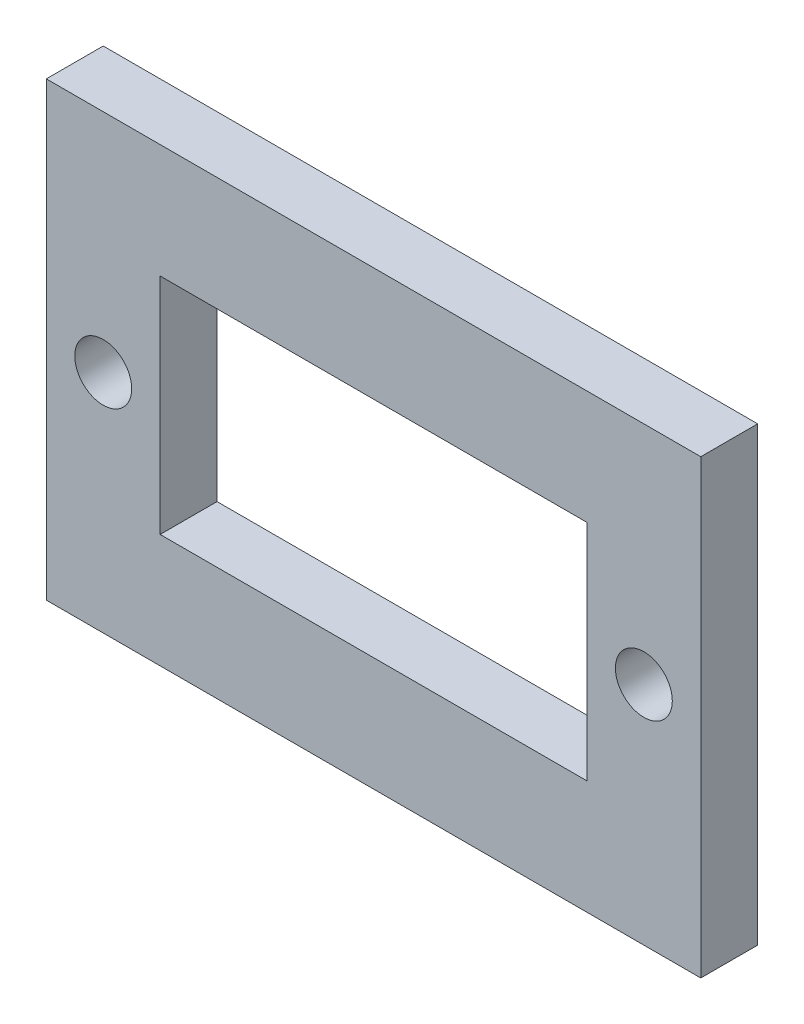
ISO-10303-21;
HEADER;
FILE_DESCRIPTION(('STEP AP214'),'2;1');
FILE_NAME('part.step','',(''),(''),'','','');
FILE_SCHEMA(('AUTOMOTIVE_DESIGN { 1 0 10303 214 1 1 1 1 }'));
ENDSEC;
DATA;
#1=APPLICATION_CONTEXT('core data for automotive mechanical design processes');
#2=APPLICATION_PROTOCOL_DEFINITION('international standard','automotive_design',2000,#1);
#3=PRODUCT_CONTEXT('',#1,'mechanical');
#4=PRODUCT('Part','Part','',(#3));
#5=PRODUCT_RELATED_PRODUCT_CATEGORY('part','',(#4));
#6=PRODUCT_DEFINITION_FORMATION('','',#4);
#7=PRODUCT_DEFINITION_CONTEXT('part definition',#1,'design');
#8=PRODUCT_DEFINITION('design','',#6,#7);
#9=PRODUCT_DEFINITION_SHAPE('','',#8);
#10=(LENGTH_UNIT() NAMED_UNIT(*) SI_UNIT(.MILLI.,.METRE.));
#11=(NAMED_UNIT(*) PLANE_ANGLE_UNIT() SI_UNIT($,.RADIAN.));
#12=(NAMED_UNIT(*) SI_UNIT($,.STERADIAN.) SOLID_ANGLE_UNIT());
#13=UNCERTAINTY_MEASURE_WITH_UNIT(LENGTH_MEASURE(1.E-05),#10,'distance_accuracy_value','');
#14=(GEOMETRIC_REPRESENTATION_CONTEXT(3) GLOBAL_UNCERTAINTY_ASSIGNED_CONTEXT((#13)) GLOBAL_UNIT_ASSIGNED_CONTEXT((#10,
#11,#12)) REPRESENTATION_CONTEXT('',''));
#15=CARTESIAN_POINT('',(0.,0.,0.));
#16=DIRECTION('',(0.,0.,1.));
#17=DIRECTION('',(1.,0.,0.));
#18=AXIS2_PLACEMENT_3D('',#15,#16,#17);
#19=CARTESIAN_POINT('',(0.,0.,3.));
#20=DIRECTION('',(0.,0.,1.));
#21=DIRECTION('',(1.,0.,0.));
#22=AXIS2_PLACEMENT_3D('',#19,#20,#21);
#23=PLANE('',#22);
#24=CARTESIAN_POINT('',(-3.,5.9,3.));
#25=DIRECTION('',(0.,0.,1.));
#26=DIRECTION('',(1.,0.,0.));
#27=AXIS2_PLACEMENT_3D('',#24,#25,#26);
#28=CIRCLE('',#27,1.5);
#29=CARTESIAN_POINT('',(-1.5,5.9,3.));
#30=VERTEX_POINT('',#29);
#31=EDGE_CURVE('E127',#30,#30,#28,.T.);
#32=ORIENTED_EDGE('',*,*,#31,.F.);
#33=EDGE_LOOP('',(#32));
#34=FACE_BOUND('',#33,.T.);
#35=DIRECTION('',(0.,1.,0.));
#36=VECTOR('',#35,1.);
#37=CARTESIAN_POINT('',(28.5,17.8,3.));
#38=LINE('',#37,#36);
#39=CARTESIAN_POINT('',(28.5,-6.,3.));
#40=VERTEX_POINT('',#39);
#41=CARTESIAN_POINT('',(28.5,17.8,3.));
#42=VERTEX_POINT('',#41);
#43=EDGE_CURVE('E137',#40,#42,#38,.T.);
#44=ORIENTED_EDGE('',*,*,#43,.T.);
#45=DIRECTION('',(-1.,0.,0.));
#46=VECTOR('',#45,1.);
#47=CARTESIAN_POINT('',(-6.00000000000001,17.8,3.));
#48=LINE('',#47,#46);
#49=CARTESIAN_POINT('',(-6.00000000000001,17.8,3.));
#50=VERTEX_POINT('',#49);
#51=EDGE_CURVE('E140',#42,#50,#48,.T.);
#52=ORIENTED_EDGE('',*,*,#51,.T.);
#53=DIRECTION('',(0.,-1.,0.));
#54=VECTOR('',#53,1.);
#55=CARTESIAN_POINT('',(-6.00000000000001,17.8,3.));
#56=LINE('',#55,#54);
#57=CARTESIAN_POINT('',(-6.00000000000001,-6.,3.));
#58=VERTEX_POINT('',#57);
#59=EDGE_CURVE('E143',#50,#58,#56,.T.);
#60=ORIENTED_EDGE('',*,*,#59,.T.);
#61=DIRECTION('',(1.,0.,0.));
#62=VECTOR('',#61,1.);
#63=CARTESIAN_POINT('',(-6.00000000000001,-6.,3.));
#64=LINE('',#63,#62);
#65=EDGE_CURVE('E145',#58,#40,#64,.T.);
#66=ORIENTED_EDGE('',*,*,#65,.T.);
#67=EDGE_LOOP('',(#44,#52,#60,#66));
#68=FACE_BOUND('',#67,.T.);
#69=DIRECTION('',(1.,0.,0.));
#70=VECTOR('',#69,1.);
#71=CARTESIAN_POINT('',(0.,0.,3.));
#72=LINE('',#71,#70);
#73=CARTESIAN_POINT('',(0.,0.,3.));
#74=VERTEX_POINT('',#73);
#75=CARTESIAN_POINT('',(22.5,0.,3.));
#76=VERTEX_POINT('',#75);
#77=EDGE_CURVE('E106',#74,#76,#72,.T.);
#78=ORIENTED_EDGE('',*,*,#77,.F.);
#79=DIRECTION('',(0.,-1.,0.));
#80=VECTOR('',#79,1.);
#81=CARTESIAN_POINT('',(0.,0.,3.));
#82=LINE('',#81,#80);
#83=CARTESIAN_POINT('',(0.,11.8,3.));
#84=VERTEX_POINT('',#83);
#85=EDGE_CURVE('E98',#84,#74,#82,.T.);
#86=ORIENTED_EDGE('',*,*,#85,.F.);
#87=DIRECTION('',(-1.,0.,0.));
#88=VECTOR('',#87,1.);
#89=CARTESIAN_POINT('',(0.,11.8,3.));
#90=LINE('',#89,#88);
#91=CARTESIAN_POINT('',(22.5,11.8,3.));
#92=VERTEX_POINT('',#91);
#93=EDGE_CURVE('E121',#92,#84,#90,.T.);
#94=ORIENTED_EDGE('',*,*,#93,.F.);
#95=DIRECTION('',(0.,1.,0.));
#96=VECTOR('',#95,1.);
#97=CARTESIAN_POINT('',(22.5,0.,3.));
#98=LINE('',#97,#96);
#99=EDGE_CURVE('E119',#76,#92,#98,.T.);
#100=ORIENTED_EDGE('',*,*,#99,.F.);
#101=EDGE_LOOP('',(#78,#86,#94,#100));
#102=FACE_BOUND('',#101,.T.);
#103=CARTESIAN_POINT('',(25.5,5.9,3.));
#104=DIRECTION('',(0.,0.,1.));
#105=DIRECTION('',(1.,0.,0.));
#106=AXIS2_PLACEMENT_3D('',#103,#104,#105);
#107=CIRCLE('',#106,1.5);
#108=CARTESIAN_POINT('',(27.,5.9,3.));
#109=VERTEX_POINT('',#108);
#110=EDGE_CURVE('E228',#109,#109,#107,.T.);
#111=ORIENTED_EDGE('',*,*,#110,.F.);
#112=EDGE_LOOP('',(#111));
#113=FACE_BOUND('',#112,.T.);
#114=ADVANCED_FACE('F33',(#34,#68,#102,#113),#23,.T.);
#115=CARTESIAN_POINT('',(0.,0.,0.));
#116=DIRECTION('',(0.,0.,1.));
#117=DIRECTION('',(1.,0.,0.));
#118=AXIS2_PLACEMENT_3D('',#115,#116,#117);
#119=PLANE('',#118);
#120=CARTESIAN_POINT('',(-3.,5.9,0.));
#121=DIRECTION('',(0.,0.,1.));
#122=DIRECTION('',(1.,0.,0.));
#123=AXIS2_PLACEMENT_3D('',#120,#121,#122);
#124=CIRCLE('',#123,1.5);
#125=CARTESIAN_POINT('',(-1.5,5.9,0.));
#126=VERTEX_POINT('',#125);
#127=EDGE_CURVE('E234',#126,#126,#124,.T.);
#128=ORIENTED_EDGE('',*,*,#127,.T.);
#129=EDGE_LOOP('',(#128));
#130=FACE_BOUND('',#129,.T.);
#131=DIRECTION('',(0.,1.,0.));
#132=VECTOR('',#131,1.);
#133=CARTESIAN_POINT('',(28.5,17.8,0.));
#134=LINE('',#133,#132);
#135=CARTESIAN_POINT('',(28.5,-6.,0.));
#136=VERTEX_POINT('',#135);
#137=CARTESIAN_POINT('',(28.5,17.8,0.));
#138=VERTEX_POINT('',#137);
#139=EDGE_CURVE('E114',#136,#138,#134,.T.);
#140=ORIENTED_EDGE('',*,*,#139,.F.);
#141=DIRECTION('',(1.,0.,0.));
#142=VECTOR('',#141,1.);
#143=CARTESIAN_POINT('',(-6.00000000000001,-6.,0.));
#144=LINE('',#143,#142);
#145=CARTESIAN_POINT('',(-6.00000000000001,-6.,0.));
#146=VERTEX_POINT('',#145);
#147=EDGE_CURVE('E141',#146,#136,#144,.T.);
#148=ORIENTED_EDGE('',*,*,#147,.F.);
#149=DIRECTION('',(0.,-1.,0.));
#150=VECTOR('',#149,1.);
#151=CARTESIAN_POINT('',(-6.00000000000001,17.8,0.));
#152=LINE('',#151,#150);
#153=CARTESIAN_POINT('',(-6.00000000000001,17.8,0.));
#154=VERTEX_POINT('',#153);
#155=EDGE_CURVE('E152',#154,#146,#152,.T.);
#156=ORIENTED_EDGE('',*,*,#155,.F.);
#157=DIRECTION('',(-1.,0.,0.));
#158=VECTOR('',#157,1.);
#159=CARTESIAN_POINT('',(-6.00000000000001,17.8,0.));
#160=LINE('',#159,#158);
#161=EDGE_CURVE('E150',#138,#154,#160,.T.);
#162=ORIENTED_EDGE('',*,*,#161,.F.);
#163=EDGE_LOOP('',(#140,#148,#156,#162));
#164=FACE_BOUND('',#163,.T.);
#165=DIRECTION('',(0.,-1.,0.));
#166=VECTOR('',#165,1.);
#167=CARTESIAN_POINT('',(0.,0.,0.));
#168=LINE('',#167,#166);
#169=CARTESIAN_POINT('',(0.,11.8,0.));
#170=VERTEX_POINT('',#169);
#171=CARTESIAN_POINT('',(0.,0.,0.));
#172=VERTEX_POINT('',#171);
#173=EDGE_CURVE('E56',#170,#172,#168,.T.);
#174=ORIENTED_EDGE('',*,*,#173,.T.);
#175=DIRECTION('',(1.,0.,0.));
#176=VECTOR('',#175,1.);
#177=CARTESIAN_POINT('',(0.,0.,0.));
#178=LINE('',#177,#176);
#179=CARTESIAN_POINT('',(22.5,0.,0.));
#180=VERTEX_POINT('',#179);
#181=EDGE_CURVE('E113',#172,#180,#178,.T.);
#182=ORIENTED_EDGE('',*,*,#181,.T.);
#183=DIRECTION('',(0.,1.,0.));
#184=VECTOR('',#183,1.);
#185=CARTESIAN_POINT('',(22.5,0.,0.));
#186=LINE('',#185,#184);
#187=CARTESIAN_POINT('',(22.5,11.8,0.));
#188=VERTEX_POINT('',#187);
#189=EDGE_CURVE('E129',#180,#188,#186,.T.);
#190=ORIENTED_EDGE('',*,*,#189,.T.);
#191=DIRECTION('',(-1.,0.,0.));
#192=VECTOR('',#191,1.);
#193=CARTESIAN_POINT('',(0.,11.8,0.));
#194=LINE('',#193,#192);
#195=EDGE_CURVE('E107',#188,#170,#194,.T.);
#196=ORIENTED_EDGE('',*,*,#195,.T.);
#197=EDGE_LOOP('',(#174,#182,#190,#196));
#198=FACE_BOUND('',#197,.T.);
#199=CARTESIAN_POINT('',(25.5,5.9,0.));
#200=DIRECTION('',(0.,0.,1.));
#201=DIRECTION('',(1.,0.,0.));
#202=AXIS2_PLACEMENT_3D('',#199,#200,#201);
#203=CIRCLE('',#202,1.5);
#204=CARTESIAN_POINT('',(27.,5.9,0.));
#205=VERTEX_POINT('',#204);
#206=EDGE_CURVE('E231',#205,#205,#203,.T.);
#207=ORIENTED_EDGE('',*,*,#206,.T.);
#208=EDGE_LOOP('',(#207));
#209=FACE_BOUND('',#208,.T.);
#210=ADVANCED_FACE('F170',(#130,#164,#198,#209),#119,.F.);
#211=CARTESIAN_POINT('',(28.5,17.8,3.));
#212=DIRECTION('',(-1.,0.,0.));
#213=DIRECTION('',(0.,0.,1.));
#214=AXIS2_PLACEMENT_3D('',#211,#212,#213);
#215=PLANE('',#214);
#216=ORIENTED_EDGE('',*,*,#139,.T.);
#217=DIRECTION('',(0.,0.,-1.));
#218=VECTOR('',#217,1.);
#219=CARTESIAN_POINT('',(28.5,17.8,3.));
#220=LINE('',#219,#218);
#221=EDGE_CURVE('E11',#42,#138,#220,.T.);
#222=ORIENTED_EDGE('',*,*,#221,.F.);
#223=ORIENTED_EDGE('',*,*,#43,.F.);
#224=DIRECTION('',(0.,0.,-1.));
#225=VECTOR('',#224,1.);
#226=CARTESIAN_POINT('',(28.5,-6.,3.));
#227=LINE('',#226,#225);
#228=EDGE_CURVE('E147',#40,#136,#227,.T.);
#229=ORIENTED_EDGE('',*,*,#228,.T.);
#230=EDGE_LOOP('',(#216,#222,#223,#229));
#231=FACE_BOUND('',#230,.T.);
#232=ADVANCED_FACE('F35',(#231),#215,.F.);
#233=CARTESIAN_POINT('',(-6.00000000000001,17.8,3.));
#234=DIRECTION('',(0.,-1.,0.));
#235=DIRECTION('',(1.,0.,0.));
#236=AXIS2_PLACEMENT_3D('',#233,#234,#235);
#237=PLANE('',#236);
#238=ORIENTED_EDGE('',*,*,#161,.T.);
#239=DIRECTION('',(0.,0.,-1.));
#240=VECTOR('',#239,1.);
#241=CARTESIAN_POINT('',(-6.00000000000001,17.8,3.));
#242=LINE('',#241,#240);
#243=EDGE_CURVE('E41',#50,#154,#242,.T.);
#244=ORIENTED_EDGE('',*,*,#243,.F.);
#245=ORIENTED_EDGE('',*,*,#51,.F.);
#246=ORIENTED_EDGE('',*,*,#221,.T.);
#247=EDGE_LOOP('',(#238,#244,#245,#246));
#248=FACE_BOUND('',#247,.T.);
#249=ADVANCED_FACE('F180',(#248),#237,.F.);
#250=CARTESIAN_POINT('',(-6.00000000000001,17.8,3.));
#251=DIRECTION('',(1.,0.,0.));
#252=DIRECTION('',(0.,1.,0.));
#253=AXIS2_PLACEMENT_3D('',#250,#251,#252);
#254=PLANE('',#253);
#255=ORIENTED_EDGE('',*,*,#155,.T.);
#256=DIRECTION('',(0.,0.,-1.));
#257=VECTOR('',#256,1.);
#258=CARTESIAN_POINT('',(-6.00000000000001,-6.,3.));
#259=LINE('',#258,#257);
#260=EDGE_CURVE('E157',#58,#146,#259,.T.);
#261=ORIENTED_EDGE('',*,*,#260,.F.);
#262=ORIENTED_EDGE('',*,*,#59,.F.);
#263=ORIENTED_EDGE('',*,*,#243,.T.);
#264=EDGE_LOOP('',(#255,#261,#262,#263));
#265=FACE_BOUND('',#264,.T.);
#266=ADVANCED_FACE('F164',(#265),#254,.F.);
#267=CARTESIAN_POINT('',(-6.00000000000001,-6.,3.));
#268=DIRECTION('',(0.,1.,0.));
#269=DIRECTION('',(-1.,0.,0.));
#270=AXIS2_PLACEMENT_3D('',#267,#268,#269);
#271=PLANE('',#270);
#272=ORIENTED_EDGE('',*,*,#147,.T.);
#273=ORIENTED_EDGE('',*,*,#228,.F.);
#274=ORIENTED_EDGE('',*,*,#65,.F.);
#275=ORIENTED_EDGE('',*,*,#260,.T.);
#276=EDGE_LOOP('',(#272,#273,#274,#275));
#277=FACE_BOUND('',#276,.T.);
#278=ADVANCED_FACE('F174',(#277),#271,.F.);
#279=CARTESIAN_POINT('',(0.,0.,3.));
#280=DIRECTION('',(1.,0.,0.));
#281=DIRECTION('',(0.,0.,-1.));
#282=AXIS2_PLACEMENT_3D('',#279,#280,#281);
#283=PLANE('',#282);
#284=ORIENTED_EDGE('',*,*,#173,.F.);
#285=DIRECTION('',(0.,0.,-1.));
#286=VECTOR('',#285,1.);
#287=CARTESIAN_POINT('',(0.,11.8,3.));
#288=LINE('',#287,#286);
#289=EDGE_CURVE('E102',#84,#170,#288,.T.);
#290=ORIENTED_EDGE('',*,*,#289,.F.);
#291=ORIENTED_EDGE('',*,*,#85,.T.);
#292=DIRECTION('',(0.,0.,-1.));
#293=VECTOR('',#292,1.);
#294=CARTESIAN_POINT('',(0.,0.,3.));
#295=LINE('',#294,#293);
#296=EDGE_CURVE('E101',#74,#172,#295,.T.);
#297=ORIENTED_EDGE('',*,*,#296,.T.);
#298=EDGE_LOOP('',(#284,#290,#291,#297));
#299=FACE_BOUND('',#298,.T.);
#300=ADVANCED_FACE('F100',(#299),#283,.T.);
#301=CARTESIAN_POINT('',(0.,0.,3.));
#302=DIRECTION('',(0.,1.,0.));
#303=DIRECTION('',(0.,0.,1.));
#304=AXIS2_PLACEMENT_3D('',#301,#302,#303);
#305=PLANE('',#304);
#306=ORIENTED_EDGE('',*,*,#181,.F.);
#307=ORIENTED_EDGE('',*,*,#296,.F.);
#308=ORIENTED_EDGE('',*,*,#77,.T.);
#309=DIRECTION('',(0.,0.,-1.));
#310=VECTOR('',#309,1.);
#311=CARTESIAN_POINT('',(22.5,0.,3.));
#312=LINE('',#311,#310);
#313=EDGE_CURVE('E115',#76,#180,#312,.T.);
#314=ORIENTED_EDGE('',*,*,#313,.T.);
#315=EDGE_LOOP('',(#306,#307,#308,#314));
#316=FACE_BOUND('',#315,.T.);
#317=ADVANCED_FACE('F110',(#316),#305,.T.);
#318=CARTESIAN_POINT('',(22.5,0.,3.));
#319=DIRECTION('',(-1.,0.,0.));
#320=DIRECTION('',(0.,0.,1.));
#321=AXIS2_PLACEMENT_3D('',#318,#319,#320);
#322=PLANE('',#321);
#323=ORIENTED_EDGE('',*,*,#189,.F.);
#324=ORIENTED_EDGE('',*,*,#313,.F.);
#325=ORIENTED_EDGE('',*,*,#99,.T.);
#326=DIRECTION('',(0.,0.,-1.));
#327=VECTOR('',#326,1.);
#328=CARTESIAN_POINT('',(22.5,11.8,3.));
#329=LINE('',#328,#327);
#330=EDGE_CURVE('E48',#92,#188,#329,.T.);
#331=ORIENTED_EDGE('',*,*,#330,.T.);
#332=EDGE_LOOP('',(#323,#324,#325,#331));
#333=FACE_BOUND('',#332,.T.);
#334=ADVANCED_FACE('F206',(#333),#322,.T.);
#335=CARTESIAN_POINT('',(0.,11.8,3.));
#336=DIRECTION('',(0.,-1.,0.));
#337=DIRECTION('',(0.,0.,-1.));
#338=AXIS2_PLACEMENT_3D('',#335,#336,#337);
#339=PLANE('',#338);
#340=ORIENTED_EDGE('',*,*,#195,.F.);
#341=ORIENTED_EDGE('',*,*,#330,.F.);
#342=ORIENTED_EDGE('',*,*,#93,.T.);
#343=ORIENTED_EDGE('',*,*,#289,.T.);
#344=EDGE_LOOP('',(#340,#341,#342,#343));
#345=FACE_BOUND('',#344,.T.);
#346=ADVANCED_FACE('F210',(#345),#339,.T.);
#347=CARTESIAN_POINT('',(-3.,5.9,3.));
#348=DIRECTION('',(0.,0.,-1.));
#349=DIRECTION('',(-1.,0.,0.));
#350=AXIS2_PLACEMENT_3D('',#347,#348,#349);
#351=CYLINDRICAL_SURFACE('',#350,1.5);
#352=ORIENTED_EDGE('',*,*,#31,.T.);
#353=EDGE_LOOP('',(#352));
#354=FACE_BOUND('',#353,.T.);
#355=ORIENTED_EDGE('',*,*,#127,.F.);
#356=EDGE_LOOP('',(#355));
#357=FACE_BOUND('',#356,.T.);
#358=ADVANCED_FACE('F216',(#354,#357),#351,.F.);
#359=CARTESIAN_POINT('',(25.5,5.9,3.));
#360=DIRECTION('',(0.,0.,-1.));
#361=DIRECTION('',(-1.,0.,0.));
#362=AXIS2_PLACEMENT_3D('',#359,#360,#361);
#363=CYLINDRICAL_SURFACE('',#362,1.5);
#364=ORIENTED_EDGE('',*,*,#110,.T.);
#365=EDGE_LOOP('',(#364));
#366=FACE_BOUND('',#365,.T.);
#367=ORIENTED_EDGE('',*,*,#206,.F.);
#368=EDGE_LOOP('',(#367));
#369=FACE_BOUND('',#368,.T.);
#370=ADVANCED_FACE('F219',(#366,#369),#363,.F.);
#371=CLOSED_SHELL('',(#114,#210,#232,#249,#266,#278,#300,#317,#334,#346,#358,#370));
#372=MANIFOLD_SOLID_BREP('B2',#371);
#373=ADVANCED_BREP_SHAPE_REPRESENTATION('',(#18,#372),#14);
#374=SHAPE_DEFINITION_REPRESENTATION(#9,#373);
ENDSEC;
END-ISO-10303-21;
